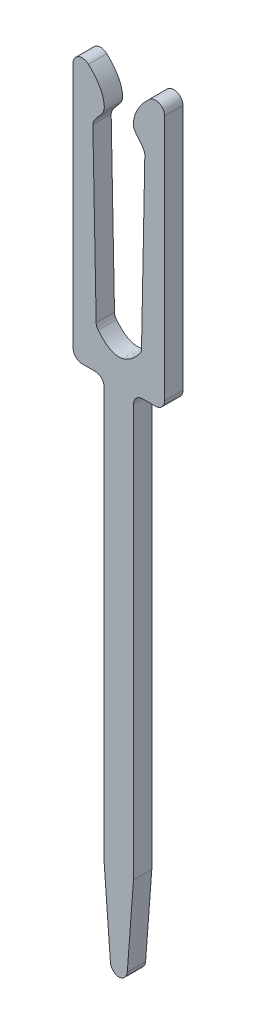
ISO-10303-21;
HEADER;
FILE_DESCRIPTION(('STEP AP214'),'2;1');
FILE_NAME('part.step','',(''),(''),'','','');
FILE_SCHEMA(('AUTOMOTIVE_DESIGN { 1 0 10303 214 1 1 1 1 }'));
ENDSEC;
DATA;
#1=APPLICATION_CONTEXT('core data for automotive mechanical design processes');
#2=APPLICATION_PROTOCOL_DEFINITION('international standard','automotive_design',2000,#1);
#3=PRODUCT_CONTEXT('',#1,'mechanical');
#4=PRODUCT('Part','Part','',(#3));
#5=PRODUCT_RELATED_PRODUCT_CATEGORY('part','',(#4));
#6=PRODUCT_DEFINITION_FORMATION('','',#4);
#7=PRODUCT_DEFINITION_CONTEXT('part definition',#1,'design');
#8=PRODUCT_DEFINITION('design','',#6,#7);
#9=PRODUCT_DEFINITION_SHAPE('','',#8);
#10=(LENGTH_UNIT() NAMED_UNIT(*) SI_UNIT(.MILLI.,.METRE.));
#11=(NAMED_UNIT(*) PLANE_ANGLE_UNIT() SI_UNIT($,.RADIAN.));
#12=(NAMED_UNIT(*) SI_UNIT($,.STERADIAN.) SOLID_ANGLE_UNIT());
#13=UNCERTAINTY_MEASURE_WITH_UNIT(LENGTH_MEASURE(1.E-05),#10,'distance_accuracy_value','');
#14=(GEOMETRIC_REPRESENTATION_CONTEXT(3) GLOBAL_UNCERTAINTY_ASSIGNED_CONTEXT((#13)) GLOBAL_UNIT_ASSIGNED_CONTEXT((#10,
#11,#12)) REPRESENTATION_CONTEXT('',''));
#15=CARTESIAN_POINT('',(0.,0.,0.));
#16=DIRECTION('',(0.,0.,1.));
#17=DIRECTION('',(1.,0.,0.));
#18=AXIS2_PLACEMENT_3D('',#15,#16,#17);
#19=CARTESIAN_POINT('',(0.0155617112013406,-9.53322485209548,-0.2));
#20=DIRECTION('',(0.,0.,1.));
#21=DIRECTION('',(1.,0.,0.));
#22=AXIS2_PLACEMENT_3D('',#19,#20,#21);
#23=CYLINDRICAL_SURFACE('',#22,0.2);
#24=CARTESIAN_POINT('',(0.0155617112013406,-9.53322485209548,0.2));
#25=DIRECTION('',(0.,0.,1.));
#26=DIRECTION('',(-1.,0.,0.));
#27=AXIS2_PLACEMENT_3D('',#24,#25,#26);
#28=CIRCLE('',#27,0.2);
#29=CARTESIAN_POINT('',(-0.183878150776374,-9.54818284174351,0.2));
#30=VERTEX_POINT('',#29);
#31=CARTESIAN_POINT('',(0.,-9.73261851584758,0.2));
#32=VERTEX_POINT('',#31);
#33=EDGE_CURVE('E221',#30,#32,#28,.T.);
#34=ORIENTED_EDGE('',*,*,#33,.F.);
#35=DIRECTION('',(0.,0.,1.));
#36=VECTOR('',#35,1.);
#37=CARTESIAN_POINT('',(-0.183878150776374,-9.54818284174351,-0.2));
#38=LINE('',#37,#36);
#39=CARTESIAN_POINT('',(-0.183878150776374,-9.54818284174351,-0.2));
#40=VERTEX_POINT('',#39);
#41=EDGE_CURVE('E11',#40,#30,#38,.T.);
#42=ORIENTED_EDGE('',*,*,#41,.F.);
#43=CARTESIAN_POINT('',(0.0155617112013406,-9.53322485209548,-0.2));
#44=DIRECTION('',(0.,0.,1.));
#45=DIRECTION('',(-1.,0.,0.));
#46=AXIS2_PLACEMENT_3D('',#43,#44,#45);
#47=CIRCLE('',#46,0.2);
#48=CARTESIAN_POINT('',(0.,-9.73261851584758,-0.2));
#49=VERTEX_POINT('',#48);
#50=EDGE_CURVE('E301',#40,#49,#47,.T.);
#51=ORIENTED_EDGE('',*,*,#50,.T.);
#52=DIRECTION('',(0.,0.,1.));
#53=VECTOR('',#52,1.);
#54=CARTESIAN_POINT('',(0.,-9.73261851584758,-0.2));
#55=LINE('',#54,#53);
#56=EDGE_CURVE('E37',#49,#32,#55,.T.);
#57=ORIENTED_EDGE('',*,*,#56,.T.);
#58=EDGE_LOOP('',(#34,#42,#51,#57));
#59=FACE_BOUND('',#58,.T.);
#60=ADVANCED_FACE('F34',(#59),#23,.T.);
#61=CARTESIAN_POINT('',(-0.183878150776374,-9.54818284174351,-0.2));
#62=DIRECTION('',(-0.997199309888568,-0.074789948240152,0.));
#63=DIRECTION('',(0.074789948240152,-0.997199309888568,0.));
#64=AXIS2_PLACEMENT_3D('',#61,#62,#63);
#65=PLANE('',#64);
#66=DIRECTION('',(0.074789948240152,-0.997199309888568,0.));
#67=VECTOR('',#66,1.);
#68=CARTESIAN_POINT('',(-0.183878150776374,-9.54818284174351,0.2));
#69=LINE('',#68,#67);
#70=CARTESIAN_POINT('',(-0.319999999997298,-7.73322485209503,0.2));
#71=VERTEX_POINT('',#70);
#72=EDGE_CURVE('E299',#71,#30,#69,.T.);
#73=ORIENTED_EDGE('',*,*,#72,.F.);
#74=DIRECTION('',(0.,0.,1.));
#75=VECTOR('',#74,1.);
#76=CARTESIAN_POINT('',(-0.319999999997298,-7.73322485209503,-0.2));
#77=LINE('',#76,#75);
#78=CARTESIAN_POINT('',(-0.319999999997298,-7.73322485209503,-0.2));
#79=VERTEX_POINT('',#78);
#80=EDGE_CURVE('E43',#79,#71,#77,.T.);
#81=ORIENTED_EDGE('',*,*,#80,.F.);
#82=DIRECTION('',(0.074789948240152,-0.997199309888568,0.));
#83=VECTOR('',#82,1.);
#84=CARTESIAN_POINT('',(-0.183878150776374,-9.54818284174351,-0.2));
#85=LINE('',#84,#83);
#86=EDGE_CURVE('E211',#79,#40,#85,.T.);
#87=ORIENTED_EDGE('',*,*,#86,.T.);
#88=ORIENTED_EDGE('',*,*,#41,.T.);
#89=EDGE_LOOP('',(#73,#81,#87,#88));
#90=FACE_BOUND('',#89,.T.);
#91=ADVANCED_FACE('F343',(#90),#65,.T.);
#92=CARTESIAN_POINT('',(-0.319999999997298,-7.73322485209503,-0.2));
#93=DIRECTION('',(-1.,0.,0.));
#94=DIRECTION('',(0.,-1.,0.));
#95=AXIS2_PLACEMENT_3D('',#92,#93,#94);
#96=PLANE('',#95);
#97=DIRECTION('',(0.,-1.,0.));
#98=VECTOR('',#97,1.);
#99=CARTESIAN_POINT('',(-0.319999999997298,-7.73322485209503,0.2));
#100=LINE('',#99,#98);
#101=CARTESIAN_POINT('',(-0.319999999997298,1.26677514790497,0.2));
#102=VERTEX_POINT('',#101);
#103=EDGE_CURVE('E198',#102,#71,#100,.T.);
#104=ORIENTED_EDGE('',*,*,#103,.F.);
#105=DIRECTION('',(0.,0.,1.));
#106=VECTOR('',#105,1.);
#107=CARTESIAN_POINT('',(-0.319999999997298,1.26677514790497,-0.2));
#108=LINE('',#107,#106);
#109=CARTESIAN_POINT('',(-0.319999999997298,1.26677514790497,-0.2));
#110=VERTEX_POINT('',#109);
#111=EDGE_CURVE('E193',#110,#102,#108,.T.);
#112=ORIENTED_EDGE('',*,*,#111,.F.);
#113=DIRECTION('',(0.,-1.,0.));
#114=VECTOR('',#113,1.);
#115=CARTESIAN_POINT('',(-0.319999999997298,-7.73322485209503,-0.2));
#116=LINE('',#115,#114);
#117=EDGE_CURVE('E196',#110,#79,#116,.T.);
#118=ORIENTED_EDGE('',*,*,#117,.T.);
#119=ORIENTED_EDGE('',*,*,#80,.T.);
#120=EDGE_LOOP('',(#104,#112,#118,#119));
#121=FACE_BOUND('',#120,.T.);
#122=ADVANCED_FACE('F195',(#121),#96,.T.);
#123=CARTESIAN_POINT('',(-0.519999999997296,1.26677514790497,-0.2));
#124=DIRECTION('',(0.,0.,1.));
#125=DIRECTION('',(1.,0.,0.));
#126=AXIS2_PLACEMENT_3D('',#123,#124,#125);
#127=CYLINDRICAL_SURFACE('',#126,0.199999999999999);
#128=CARTESIAN_POINT('',(-0.519999999997296,1.26677514790497,0.2));
#129=DIRECTION('',(0.,0.,-1.));
#130=DIRECTION('',(1.,0.,0.));
#131=AXIS2_PLACEMENT_3D('',#128,#129,#130);
#132=CIRCLE('',#131,0.199999999999999);
#133=CARTESIAN_POINT('',(-0.519999999997296,1.46677514790497,0.2));
#134=VERTEX_POINT('',#133);
#135=EDGE_CURVE('E296',#134,#102,#132,.T.);
#136=ORIENTED_EDGE('',*,*,#135,.F.);
#137=DIRECTION('',(0.,0.,1.));
#138=VECTOR('',#137,1.);
#139=CARTESIAN_POINT('',(-0.519999999997296,1.46677514790497,-0.2));
#140=LINE('',#139,#138);
#141=CARTESIAN_POINT('',(-0.519999999997296,1.46677514790497,-0.2));
#142=VERTEX_POINT('',#141);
#143=EDGE_CURVE('E203',#142,#134,#140,.T.);
#144=ORIENTED_EDGE('',*,*,#143,.F.);
#145=CARTESIAN_POINT('',(-0.519999999997296,1.26677514790497,-0.2));
#146=DIRECTION('',(0.,0.,-1.));
#147=DIRECTION('',(1.,0.,0.));
#148=AXIS2_PLACEMENT_3D('',#145,#146,#147);
#149=CIRCLE('',#148,0.199999999999999);
#150=EDGE_CURVE('E209',#142,#110,#149,.T.);
#151=ORIENTED_EDGE('',*,*,#150,.T.);
#152=ORIENTED_EDGE('',*,*,#111,.T.);
#153=EDGE_LOOP('',(#136,#144,#151,#152));
#154=FACE_BOUND('',#153,.T.);
#155=ADVANCED_FACE('F213',(#154),#127,.F.);
#156=CARTESIAN_POINT('',(-0.519999999997296,1.46677514790497,-0.2));
#157=DIRECTION('',(0.,-1.,0.));
#158=DIRECTION('',(0.,0.,-1.));
#159=AXIS2_PLACEMENT_3D('',#156,#157,#158);
#160=PLANE('',#159);
#161=DIRECTION('',(1.,0.,0.));
#162=VECTOR('',#161,1.);
#163=CARTESIAN_POINT('',(-0.519999999997296,1.46677514790497,0.2));
#164=LINE('',#163,#162);
#165=CARTESIAN_POINT('',(-0.799999999997301,1.46677514790497,0.2));
#166=VERTEX_POINT('',#165);
#167=EDGE_CURVE('E293',#166,#134,#164,.T.);
#168=ORIENTED_EDGE('',*,*,#167,.F.);
#169=DIRECTION('',(0.,0.,1.));
#170=VECTOR('',#169,1.);
#171=CARTESIAN_POINT('',(-0.799999999997301,1.46677514790497,-0.2));
#172=LINE('',#171,#170);
#173=CARTESIAN_POINT('',(-0.799999999997301,1.46677514790497,-0.2));
#174=VERTEX_POINT('',#173);
#175=EDGE_CURVE('E305',#174,#166,#172,.T.);
#176=ORIENTED_EDGE('',*,*,#175,.F.);
#177=DIRECTION('',(1.,0.,0.));
#178=VECTOR('',#177,1.);
#179=CARTESIAN_POINT('',(-0.519999999997296,1.46677514790497,-0.2));
#180=LINE('',#179,#178);
#181=EDGE_CURVE('E214',#174,#142,#180,.T.);
#182=ORIENTED_EDGE('',*,*,#181,.T.);
#183=ORIENTED_EDGE('',*,*,#143,.T.);
#184=EDGE_LOOP('',(#168,#176,#182,#183));
#185=FACE_BOUND('',#184,.T.);
#186=ADVANCED_FACE('F356',(#185),#160,.T.);
#187=CARTESIAN_POINT('',(-0.799999999997301,1.66677514790497,-0.2));
#188=DIRECTION('',(0.,0.,1.));
#189=DIRECTION('',(1.,0.,0.));
#190=AXIS2_PLACEMENT_3D('',#187,#188,#189);
#191=CYLINDRICAL_SURFACE('',#190,0.199999999999999);
#192=CARTESIAN_POINT('',(-0.799999999997301,1.66677514790497,0.2));
#193=DIRECTION('',(0.,0.,1.));
#194=DIRECTION('',(-1.,0.,0.));
#195=AXIS2_PLACEMENT_3D('',#192,#193,#194);
#196=CIRCLE('',#195,0.199999999999999);
#197=CARTESIAN_POINT('',(-0.999999999997299,1.66677514790497,0.2));
#198=VERTEX_POINT('',#197);
#199=EDGE_CURVE('E290',#198,#166,#196,.T.);
#200=ORIENTED_EDGE('',*,*,#199,.F.);
#201=DIRECTION('',(0.,0.,1.));
#202=VECTOR('',#201,1.);
#203=CARTESIAN_POINT('',(-0.999999999997299,1.66677514790497,-0.2));
#204=LINE('',#203,#202);
#205=CARTESIAN_POINT('',(-0.999999999997299,1.66677514790497,-0.2));
#206=VERTEX_POINT('',#205);
#207=EDGE_CURVE('E307',#206,#198,#204,.T.);
#208=ORIENTED_EDGE('',*,*,#207,.F.);
#209=CARTESIAN_POINT('',(-0.799999999997301,1.66677514790497,-0.2));
#210=DIRECTION('',(0.,0.,1.));
#211=DIRECTION('',(-1.,0.,0.));
#212=AXIS2_PLACEMENT_3D('',#209,#210,#211);
#213=CIRCLE('',#212,0.199999999999999);
#214=EDGE_CURVE('E216',#206,#174,#213,.T.);
#215=ORIENTED_EDGE('',*,*,#214,.T.);
#216=ORIENTED_EDGE('',*,*,#175,.T.);
#217=EDGE_LOOP('',(#200,#208,#215,#216));
#218=FACE_BOUND('',#217,.T.);
#219=ADVANCED_FACE('F359',(#218),#191,.T.);
#220=CARTESIAN_POINT('',(-0.999999999997299,1.66677514790497,-0.2));
#221=DIRECTION('',(-1.,0.,0.));
#222=DIRECTION('',(0.,0.,1.));
#223=AXIS2_PLACEMENT_3D('',#220,#221,#222);
#224=PLANE('',#223);
#225=DIRECTION('',(0.,-1.,0.));
#226=VECTOR('',#225,1.);
#227=CARTESIAN_POINT('',(-0.999999999997299,1.66677514790497,0.2));
#228=LINE('',#227,#226);
#229=CARTESIAN_POINT('',(-0.999999999997299,7.05719868487585,0.2));
#230=VERTEX_POINT('',#229);
#231=EDGE_CURVE('E287',#230,#198,#228,.T.);
#232=ORIENTED_EDGE('',*,*,#231,.F.);
#233=DIRECTION('',(0.,0.,1.));
#234=VECTOR('',#233,1.);
#235=CARTESIAN_POINT('',(-0.999999999997299,7.05719868487585,-0.2));
#236=LINE('',#235,#234);
#237=CARTESIAN_POINT('',(-0.999999999997299,7.05719868487585,-0.2));
#238=VERTEX_POINT('',#237);
#239=EDGE_CURVE('E309',#238,#230,#236,.T.);
#240=ORIENTED_EDGE('',*,*,#239,.F.);
#241=DIRECTION('',(0.,-1.,0.));
#242=VECTOR('',#241,1.);
#243=CARTESIAN_POINT('',(-0.999999999997299,1.66677514790497,-0.2));
#244=LINE('',#243,#242);
#245=EDGE_CURVE('E394',#238,#206,#244,.T.);
#246=ORIENTED_EDGE('',*,*,#245,.T.);
#247=ORIENTED_EDGE('',*,*,#207,.T.);
#248=EDGE_LOOP('',(#232,#240,#246,#247));
#249=FACE_BOUND('',#248,.T.);
#250=ADVANCED_FACE('F363',(#249),#224,.T.);
#251=CARTESIAN_POINT('',(-0.799999999997313,7.05719868487585,-0.2));
#252=DIRECTION('',(0.,0.,1.));
#253=DIRECTION('',(1.,0.,0.));
#254=AXIS2_PLACEMENT_3D('',#251,#252,#253);
#255=CYLINDRICAL_SURFACE('',#254,0.199999999999987);
#256=CARTESIAN_POINT('',(-0.799999999997313,7.05719868487585,0.2));
#257=DIRECTION('',(0.,0.,1.));
#258=DIRECTION('',(-1.,0.,0.));
#259=AXIS2_PLACEMENT_3D('',#256,#257,#258);
#260=CIRCLE('',#259,0.199999999999987);
#261=CARTESIAN_POINT('',(-0.663039519004161,7.20294444517823,0.2));
#262=VERTEX_POINT('',#261);
#263=EDGE_CURVE('E281',#262,#230,#260,.T.);
#264=ORIENTED_EDGE('',*,*,#263,.F.);
#265=DIRECTION('',(0.,0.,1.));
#266=VECTOR('',#265,1.);
#267=CARTESIAN_POINT('',(-0.663039519004161,7.20294444517823,-0.2));
#268=LINE('',#267,#266);
#269=CARTESIAN_POINT('',(-0.663039519004161,7.20294444517823,-0.2));
#270=VERTEX_POINT('',#269);
#271=EDGE_CURVE('E311',#270,#262,#268,.T.);
#272=ORIENTED_EDGE('',*,*,#271,.F.);
#273=CARTESIAN_POINT('',(-0.799999999997313,7.05719868487585,-0.2));
#274=DIRECTION('',(0.,0.,1.));
#275=DIRECTION('',(-1.,0.,0.));
#276=AXIS2_PLACEMENT_3D('',#273,#274,#275);
#277=CIRCLE('',#276,0.199999999999987);
#278=EDGE_CURVE('E386',#270,#238,#277,.T.);
#279=ORIENTED_EDGE('',*,*,#278,.T.);
#280=ORIENTED_EDGE('',*,*,#239,.T.);
#281=EDGE_LOOP('',(#264,#272,#279,#280));
#282=FACE_BOUND('',#281,.T.);
#283=ADVANCED_FACE('F367',(#282),#255,.T.);
#284=CARTESIAN_POINT('',(-0.567669207755582,6.10834496937554,-0.2));
#285=CARTESIAN_POINT('',(-0.548453887561712,6.27598469580024,-0.2));
#286=CARTESIAN_POINT('',(-0.31067113223224,6.38824738927313,-0.2));
#287=CARTESIAN_POINT('',(-0.326177603548469,6.81615503897428,-0.2));
#288=CARTESIAN_POINT('',(-0.487599251440381,7.03807938574774,-0.2));
#289=CARTESIAN_POINT('',(-0.663039519004161,7.20294444517823,-0.2));
#290=B_SPLINE_CURVE_WITH_KNOTS('',3,(#284,#285,#286,#287,#288,#289),.UNSPECIFIED.,.F.,.F.,(4,1,
1,4),(0.253308427317744,0.546240991694777,0.590136450844154,1.),.UNSPECIFIED.);
#291=DIRECTION('',(0.,0.,1.));
#292=VECTOR('',#291,1.);
#293=SURFACE_OF_LINEAR_EXTRUSION('',#290,#292);
#294=CARTESIAN_POINT('',(-0.567669207755582,6.10834496937554,0.2));
#295=CARTESIAN_POINT('',(-0.548453887561712,6.27598469580024,0.2));
#296=CARTESIAN_POINT('',(-0.31067113223224,6.38824738927313,0.2));
#297=CARTESIAN_POINT('',(-0.326177603548469,6.81615503897428,0.2));
#298=CARTESIAN_POINT('',(-0.487599251440381,7.03807938574774,0.2));
#299=CARTESIAN_POINT('',(-0.663039519004161,7.20294444517823,0.2));
#300=B_SPLINE_CURVE_WITH_KNOTS('',3,(#294,#295,#296,#297,#298,#299),.UNSPECIFIED.,.F.,.F.,(4,1,
1,4),(0.253308427317744,0.546240991694777,0.590136450844154,1.),.UNSPECIFIED.);
#301=CARTESIAN_POINT('',(-0.567669207755582,6.10834496937554,0.2));
#302=VERTEX_POINT('',#301);
#303=EDGE_CURVE('E276',#302,#262,#300,.T.);
#304=ORIENTED_EDGE('',*,*,#303,.F.);
#305=DIRECTION('',(0.,0.,1.));
#306=VECTOR('',#305,1.);
#307=CARTESIAN_POINT('',(-0.567669207755582,6.10834496937554,-0.2));
#308=LINE('',#307,#306);
#309=CARTESIAN_POINT('',(-0.567669207755582,6.10834496937554,-0.2));
#310=VERTEX_POINT('',#309);
#311=EDGE_CURVE('E313',#310,#302,#308,.T.);
#312=ORIENTED_EDGE('',*,*,#311,.F.);
#313=EDGE_CURVE('E379',#310,#270,#290,.T.);
#314=ORIENTED_EDGE('',*,*,#313,.T.);
#315=ORIENTED_EDGE('',*,*,#271,.T.);
#316=EDGE_LOOP('',(#304,#312,#314,#315));
#317=FACE_BOUND('',#316,.T.);
#318=ADVANCED_FACE('F371',(#317),#293,.T.);
#319=CARTESIAN_POINT('',(-0.567669207755582,6.10834496937554,-0.2));
#320=DIRECTION('',(0.999809016262246,0.0195430550508496,0.));
#321=DIRECTION('',(-0.0195430550508496,0.999809016262246,0.));
#322=AXIS2_PLACEMENT_3D('',#319,#320,#321);
#323=PLANE('',#322);
#324=DIRECTION('',(-0.0195430550508496,0.999809016262246,0.));
#325=VECTOR('',#324,1.);
#326=CARTESIAN_POINT('',(-0.567669207755582,6.10834496937554,0.2));
#327=LINE('',#326,#325);
#328=CARTESIAN_POINT('',(-0.495215905001466,2.40168471778945,0.2));
#329=VERTEX_POINT('',#328);
#330=EDGE_CURVE('E273',#329,#302,#327,.T.);
#331=ORIENTED_EDGE('',*,*,#330,.F.);
#332=DIRECTION('',(0.,0.,1.));
#333=VECTOR('',#332,1.);
#334=CARTESIAN_POINT('',(-0.495215905001466,2.40168471778945,-0.2));
#335=LINE('',#334,#333);
#336=CARTESIAN_POINT('',(-0.495215905001466,2.40168471778945,-0.2));
#337=VERTEX_POINT('',#336);
#338=EDGE_CURVE('E315',#337,#329,#335,.T.);
#339=ORIENTED_EDGE('',*,*,#338,.F.);
#340=DIRECTION('',(-0.0195430550508496,0.999809016262246,0.));
#341=VECTOR('',#340,1.);
#342=CARTESIAN_POINT('',(-0.567669207755582,6.10834496937554,-0.2));
#343=LINE('',#342,#341);
#344=EDGE_CURVE('E387',#337,#310,#343,.T.);
#345=ORIENTED_EDGE('',*,*,#344,.T.);
#346=ORIENTED_EDGE('',*,*,#311,.T.);
#347=EDGE_LOOP('',(#331,#339,#345,#346));
#348=FACE_BOUND('',#347,.T.);
#349=ADVANCED_FACE('F376',(#348),#323,.T.);
#350=CARTESIAN_POINT('',(-0.295254101749009,2.40559332879962,-0.2));
#351=DIRECTION('',(0.,0.,1.));
#352=DIRECTION('',(1.,0.,0.));
#353=AXIS2_PLACEMENT_3D('',#350,#351,#352);
#354=CYLINDRICAL_SURFACE('',#353,0.200000000000008);
#355=CARTESIAN_POINT('',(-0.295254101749009,2.40559332879962,0.2));
#356=DIRECTION('',(0.,0.,-1.));
#357=DIRECTION('',(1.,0.,0.));
#358=AXIS2_PLACEMENT_3D('',#355,#356,#357);
#359=CIRCLE('',#358,0.200000000000008);
#360=CARTESIAN_POINT('',(-0.451053838511068,2.28018821716187,0.2));
#361=VERTEX_POINT('',#360);
#362=EDGE_CURVE('E267',#361,#329,#359,.T.);
#363=ORIENTED_EDGE('',*,*,#362,.F.);
#364=DIRECTION('',(0.,0.,1.));
#365=VECTOR('',#364,1.);
#366=CARTESIAN_POINT('',(-0.451053838511068,2.28018821716187,-0.2));
#367=LINE('',#366,#365);
#368=CARTESIAN_POINT('',(-0.451053838511068,2.28018821716187,-0.2));
#369=VERTEX_POINT('',#368);
#370=EDGE_CURVE('E317',#369,#361,#367,.T.);
#371=ORIENTED_EDGE('',*,*,#370,.F.);
#372=CARTESIAN_POINT('',(-0.295254101749009,2.40559332879962,-0.2));
#373=DIRECTION('',(0.,0.,-1.));
#374=DIRECTION('',(1.,0.,0.));
#375=AXIS2_PLACEMENT_3D('',#372,#373,#374);
#376=CIRCLE('',#375,0.200000000000008);
#377=EDGE_CURVE('E412',#369,#337,#376,.T.);
#378=ORIENTED_EDGE('',*,*,#377,.T.);
#379=ORIENTED_EDGE('',*,*,#338,.T.);
#380=EDGE_LOOP('',(#363,#371,#378,#379));
#381=FACE_BOUND('',#380,.T.);
#382=ADVANCED_FACE('F431',(#381),#354,.F.);
#383=CARTESIAN_POINT('',(0.451053838511063,2.28018821716187,-0.2));
#384=CARTESIAN_POINT('',(0.,1.71981178283813,-0.2));
#385=CARTESIAN_POINT('',(-0.451053838511063,2.28018821716187,-0.2));
#386=B_SPLINE_CURVE_WITH_KNOTS('',2,(#383,#384,#385),.UNSPECIFIED.,.F.,.F.,(3,3),
(0.0434047342329982,0.956595265767001),.UNSPECIFIED.);
#387=DIRECTION('',(0.,0.,1.));
#388=VECTOR('',#387,1.);
#389=SURFACE_OF_LINEAR_EXTRUSION('',#386,#388);
#390=CARTESIAN_POINT('',(0.451053838511063,2.28018821716187,0.2));
#391=CARTESIAN_POINT('',(0.,1.71981178283813,0.2));
#392=CARTESIAN_POINT('',(-0.451053838511063,2.28018821716187,0.2));
#393=B_SPLINE_CURVE_WITH_KNOTS('',2,(#390,#391,#392),.UNSPECIFIED.,.F.,.F.,(3,3),
(0.0434047342329982,0.956595265767001),.UNSPECIFIED.);
#394=CARTESIAN_POINT('',(0.451053838511063,2.28018821716187,0.2));
#395=VERTEX_POINT('',#394);
#396=EDGE_CURVE('E262',#395,#361,#393,.T.);
#397=ORIENTED_EDGE('',*,*,#396,.F.);
#398=DIRECTION('',(0.,0.,1.));
#399=VECTOR('',#398,1.);
#400=CARTESIAN_POINT('',(0.451053838511063,2.28018821716187,-0.2));
#401=LINE('',#400,#399);
#402=CARTESIAN_POINT('',(0.451053838511063,2.28018821716187,-0.2));
#403=VERTEX_POINT('',#402);
#404=EDGE_CURVE('E319',#403,#395,#401,.T.);
#405=ORIENTED_EDGE('',*,*,#404,.F.);
#406=EDGE_CURVE('E413',#403,#369,#386,.T.);
#407=ORIENTED_EDGE('',*,*,#406,.T.);
#408=ORIENTED_EDGE('',*,*,#370,.T.);
#409=EDGE_LOOP('',(#397,#405,#407,#408));
#410=FACE_BOUND('',#409,.T.);
#411=ADVANCED_FACE('F427',(#410),#389,.T.);
#412=CARTESIAN_POINT('',(0.29525410174901,2.40559332879962,-0.2));
#413=DIRECTION('',(0.,0.,1.));
#414=DIRECTION('',(1.,0.,0.));
#415=AXIS2_PLACEMENT_3D('',#412,#413,#414);
#416=CYLINDRICAL_SURFACE('',#415,0.200000000000008);
#417=CARTESIAN_POINT('',(0.29525410174901,2.40559332879962,0.2));
#418=DIRECTION('',(0.,0.,-1.));
#419=DIRECTION('',(-1.,0.,0.));
#420=AXIS2_PLACEMENT_3D('',#417,#418,#419);
#421=CIRCLE('',#420,0.200000000000008);
#422=CARTESIAN_POINT('',(0.495215905001468,2.40168471778945,0.2));
#423=VERTEX_POINT('',#422);
#424=EDGE_CURVE('E259',#423,#395,#421,.T.);
#425=ORIENTED_EDGE('',*,*,#424,.F.);
#426=DIRECTION('',(0.,0.,1.));
#427=VECTOR('',#426,1.);
#428=CARTESIAN_POINT('',(0.495215905001468,2.40168471778945,-0.2));
#429=LINE('',#428,#427);
#430=CARTESIAN_POINT('',(0.495215905001468,2.40168471778945,-0.2));
#431=VERTEX_POINT('',#430);
#432=EDGE_CURVE('E321',#431,#423,#429,.T.);
#433=ORIENTED_EDGE('',*,*,#432,.F.);
#434=CARTESIAN_POINT('',(0.29525410174901,2.40559332879962,-0.2));
#435=DIRECTION('',(0.,0.,-1.));
#436=DIRECTION('',(-1.,0.,0.));
#437=AXIS2_PLACEMENT_3D('',#434,#435,#436);
#438=CIRCLE('',#437,0.200000000000008);
#439=EDGE_CURVE('E416',#431,#403,#438,.T.);
#440=ORIENTED_EDGE('',*,*,#439,.T.);
#441=ORIENTED_EDGE('',*,*,#404,.T.);
#442=EDGE_LOOP('',(#425,#433,#440,#441));
#443=FACE_BOUND('',#442,.T.);
#444=ADVANCED_FACE('F430',(#443),#416,.F.);
#445=CARTESIAN_POINT('',(0.567669207755584,6.10834496937554,-0.2));
#446=DIRECTION('',(-0.999809016262246,0.0195430550508496,0.));
#447=DIRECTION('',(-0.0195430550508496,-0.999809016262246,0.));
#448=AXIS2_PLACEMENT_3D('',#445,#446,#447);
#449=PLANE('',#448);
#450=DIRECTION('',(-0.0195430550508496,-0.999809016262246,0.));
#451=VECTOR('',#450,1.);
#452=CARTESIAN_POINT('',(0.567669207755584,6.10834496937554,0.2));
#453=LINE('',#452,#451);
#454=CARTESIAN_POINT('',(0.567669207755584,6.10834496937554,0.2));
#455=VERTEX_POINT('',#454);
#456=EDGE_CURVE('E253',#455,#423,#453,.T.);
#457=ORIENTED_EDGE('',*,*,#456,.F.);
#458=DIRECTION('',(0.,0.,1.));
#459=VECTOR('',#458,1.);
#460=CARTESIAN_POINT('',(0.567669207755584,6.10834496937554,-0.2));
#461=LINE('',#460,#459);
#462=CARTESIAN_POINT('',(0.567669207755584,6.10834496937554,-0.2));
#463=VERTEX_POINT('',#462);
#464=EDGE_CURVE('E323',#463,#455,#461,.T.);
#465=ORIENTED_EDGE('',*,*,#464,.F.);
#466=DIRECTION('',(-0.0195430550508496,-0.999809016262246,0.));
#467=VECTOR('',#466,1.);
#468=CARTESIAN_POINT('',(0.567669207755584,6.10834496937554,-0.2));
#469=LINE('',#468,#467);
#470=EDGE_CURVE('E453',#463,#431,#469,.T.);
#471=ORIENTED_EDGE('',*,*,#470,.T.);
#472=ORIENTED_EDGE('',*,*,#432,.T.);
#473=EDGE_LOOP('',(#457,#465,#471,#472));
#474=FACE_BOUND('',#473,.T.);
#475=ADVANCED_FACE('F435',(#474),#449,.T.);
#476=CARTESIAN_POINT('',(0.663039519004162,7.20294444517823,-0.2));
#477=CARTESIAN_POINT('',(0.487599251440373,7.03807938574778,-0.2));
#478=CARTESIAN_POINT('',(0.326177603548459,6.8161550389743,-0.2));
#479=CARTESIAN_POINT('',(0.310671132232229,6.38824738927312,-0.2));
#480=CARTESIAN_POINT('',(0.548453887561716,6.27598469580024,-0.2));
#481=CARTESIAN_POINT('',(0.567669207755584,6.10834496937554,-0.2));
#482=B_SPLINE_CURVE_WITH_KNOTS('',3,(#476,#477,#478,#479,#480,#481),.UNSPECIFIED.,.F.,.F.,(4,1,
1,4),(0.253308427317744,0.66317197647359,0.707067435622967,1.),.UNSPECIFIED.);
#483=DIRECTION('',(0.,0.,1.));
#484=VECTOR('',#483,1.);
#485=SURFACE_OF_LINEAR_EXTRUSION('',#482,#484);
#486=CARTESIAN_POINT('',(0.663039519004162,7.20294444517823,0.2));
#487=CARTESIAN_POINT('',(0.487599251440373,7.03807938574778,0.2));
#488=CARTESIAN_POINT('',(0.326177603548459,6.8161550389743,0.2));
#489=CARTESIAN_POINT('',(0.310671132232229,6.38824738927312,0.2));
#490=CARTESIAN_POINT('',(0.548453887561716,6.27598469580024,0.2));
#491=CARTESIAN_POINT('',(0.567669207755584,6.10834496937554,0.2));
#492=B_SPLINE_CURVE_WITH_KNOTS('',3,(#486,#487,#488,#489,#490,#491),.UNSPECIFIED.,.F.,.F.,(4,1,
1,4),(0.253308427317744,0.66317197647359,0.707067435622967,1.),.UNSPECIFIED.);
#493=CARTESIAN_POINT('',(0.663039519004162,7.20294444517823,0.2));
#494=VERTEX_POINT('',#493);
#495=EDGE_CURVE('E248',#494,#455,#492,.T.);
#496=ORIENTED_EDGE('',*,*,#495,.F.);
#497=DIRECTION('',(0.,0.,1.));
#498=VECTOR('',#497,1.);
#499=CARTESIAN_POINT('',(0.663039519004162,7.20294444517823,-0.2));
#500=LINE('',#499,#498);
#501=CARTESIAN_POINT('',(0.663039519004162,7.20294444517823,-0.2));
#502=VERTEX_POINT('',#501);
#503=EDGE_CURVE('E325',#502,#494,#500,.T.);
#504=ORIENTED_EDGE('',*,*,#503,.F.);
#505=EDGE_CURVE('E447',#502,#463,#482,.T.);
#506=ORIENTED_EDGE('',*,*,#505,.T.);
#507=ORIENTED_EDGE('',*,*,#464,.T.);
#508=EDGE_LOOP('',(#496,#504,#506,#507));
#509=FACE_BOUND('',#508,.T.);
#510=ADVANCED_FACE('F439',(#509),#485,.T.);
#511=CARTESIAN_POINT('',(0.799999999997314,7.05719868487585,-0.2));
#512=DIRECTION('',(0.,0.,1.));
#513=DIRECTION('',(1.,0.,0.));
#514=AXIS2_PLACEMENT_3D('',#511,#512,#513);
#515=CYLINDRICAL_SURFACE('',#514,0.199999999999987);
#516=CARTESIAN_POINT('',(0.799999999997314,7.05719868487585,0.2));
#517=DIRECTION('',(0.,0.,1.));
#518=DIRECTION('',(1.,0.,0.));
#519=AXIS2_PLACEMENT_3D('',#516,#517,#518);
#520=CIRCLE('',#519,0.199999999999987);
#521=CARTESIAN_POINT('',(0.999999999997301,7.05719868487585,0.2));
#522=VERTEX_POINT('',#521);
#523=EDGE_CURVE('E245',#522,#494,#520,.T.);
#524=ORIENTED_EDGE('',*,*,#523,.F.);
#525=DIRECTION('',(0.,0.,1.));
#526=VECTOR('',#525,1.);
#527=CARTESIAN_POINT('',(0.999999999997301,7.05719868487585,-0.2));
#528=LINE('',#527,#526);
#529=CARTESIAN_POINT('',(0.999999999997301,7.05719868487585,-0.2));
#530=VERTEX_POINT('',#529);
#531=EDGE_CURVE('E327',#530,#522,#528,.T.);
#532=ORIENTED_EDGE('',*,*,#531,.F.);
#533=CARTESIAN_POINT('',(0.799999999997314,7.05719868487585,-0.2));
#534=DIRECTION('',(0.,0.,1.));
#535=DIRECTION('',(1.,0.,0.));
#536=AXIS2_PLACEMENT_3D('',#533,#534,#535);
#537=CIRCLE('',#536,0.199999999999987);
#538=EDGE_CURVE('E454',#530,#502,#537,.T.);
#539=ORIENTED_EDGE('',*,*,#538,.T.);
#540=ORIENTED_EDGE('',*,*,#503,.T.);
#541=EDGE_LOOP('',(#524,#532,#539,#540));
#542=FACE_BOUND('',#541,.T.);
#543=ADVANCED_FACE('F444',(#542),#515,.T.);
#544=CARTESIAN_POINT('',(0.999999999997301,1.66677514790497,-0.2));
#545=DIRECTION('',(1.,0.,0.));
#546=DIRECTION('',(0.,0.,-1.));
#547=AXIS2_PLACEMENT_3D('',#544,#545,#546);
#548=PLANE('',#547);
#549=DIRECTION('',(0.,1.,0.));
#550=VECTOR('',#549,1.);
#551=CARTESIAN_POINT('',(0.999999999997301,1.66677514790497,0.2));
#552=LINE('',#551,#550);
#553=CARTESIAN_POINT('',(0.999999999997301,1.66677514790497,0.2));
#554=VERTEX_POINT('',#553);
#555=EDGE_CURVE('E242',#554,#522,#552,.T.);
#556=ORIENTED_EDGE('',*,*,#555,.F.);
#557=DIRECTION('',(0.,0.,1.));
#558=VECTOR('',#557,1.);
#559=CARTESIAN_POINT('',(0.999999999997301,1.66677514790497,-0.2));
#560=LINE('',#559,#558);
#561=CARTESIAN_POINT('',(0.999999999997301,1.66677514790497,-0.2));
#562=VERTEX_POINT('',#561);
#563=EDGE_CURVE('E329',#562,#554,#560,.T.);
#564=ORIENTED_EDGE('',*,*,#563,.F.);
#565=DIRECTION('',(0.,1.,0.));
#566=VECTOR('',#565,1.);
#567=CARTESIAN_POINT('',(0.999999999997301,1.66677514790497,-0.2));
#568=LINE('',#567,#566);
#569=EDGE_CURVE('E476',#562,#530,#568,.T.);
#570=ORIENTED_EDGE('',*,*,#569,.T.);
#571=ORIENTED_EDGE('',*,*,#531,.T.);
#572=EDGE_LOOP('',(#556,#564,#570,#571));
#573=FACE_BOUND('',#572,.T.);
#574=ADVANCED_FACE('F516',(#573),#548,.T.);
#575=CARTESIAN_POINT('',(0.799999999997302,1.66677514790497,-0.2));
#576=DIRECTION('',(0.,0.,1.));
#577=DIRECTION('',(1.,0.,0.));
#578=AXIS2_PLACEMENT_3D('',#575,#576,#577);
#579=CYLINDRICAL_SURFACE('',#578,0.199999999999999);
#580=CARTESIAN_POINT('',(0.799999999997302,1.66677514790497,0.2));
#581=DIRECTION('',(0.,0.,1.));
#582=DIRECTION('',(1.,0.,0.));
#583=AXIS2_PLACEMENT_3D('',#580,#581,#582);
#584=CIRCLE('',#583,0.199999999999999);
#585=CARTESIAN_POINT('',(0.799999999997302,1.46677514790497,0.2));
#586=VERTEX_POINT('',#585);
#587=EDGE_CURVE('E239',#586,#554,#584,.T.);
#588=ORIENTED_EDGE('',*,*,#587,.F.);
#589=DIRECTION('',(0.,0.,1.));
#590=VECTOR('',#589,1.);
#591=CARTESIAN_POINT('',(0.799999999997302,1.46677514790497,-0.2));
#592=LINE('',#591,#590);
#593=CARTESIAN_POINT('',(0.799999999997302,1.46677514790497,-0.2));
#594=VERTEX_POINT('',#593);
#595=EDGE_CURVE('E331',#594,#586,#592,.T.);
#596=ORIENTED_EDGE('',*,*,#595,.F.);
#597=CARTESIAN_POINT('',(0.799999999997302,1.66677514790497,-0.2));
#598=DIRECTION('',(0.,0.,1.));
#599=DIRECTION('',(1.,0.,0.));
#600=AXIS2_PLACEMENT_3D('',#597,#598,#599);
#601=CIRCLE('',#600,0.199999999999999);
#602=EDGE_CURVE('E477',#594,#562,#601,.T.);
#603=ORIENTED_EDGE('',*,*,#602,.T.);
#604=ORIENTED_EDGE('',*,*,#563,.T.);
#605=EDGE_LOOP('',(#588,#596,#603,#604));
#606=FACE_BOUND('',#605,.T.);
#607=ADVANCED_FACE('F514',(#606),#579,.T.);
#608=CARTESIAN_POINT('',(0.519999999997298,1.46677514790497,-0.2));
#609=DIRECTION('',(0.,-1.,0.));
#610=DIRECTION('',(0.,0.,-1.));
#611=AXIS2_PLACEMENT_3D('',#608,#609,#610);
#612=PLANE('',#611);
#613=DIRECTION('',(1.,0.,0.));
#614=VECTOR('',#613,1.);
#615=CARTESIAN_POINT('',(0.519999999997298,1.46677514790497,0.2));
#616=LINE('',#615,#614);
#617=CARTESIAN_POINT('',(0.519999999997298,1.46677514790497,0.2));
#618=VERTEX_POINT('',#617);
#619=EDGE_CURVE('E236',#618,#586,#616,.T.);
#620=ORIENTED_EDGE('',*,*,#619,.F.);
#621=DIRECTION('',(0.,0.,1.));
#622=VECTOR('',#621,1.);
#623=CARTESIAN_POINT('',(0.519999999997298,1.46677514790497,-0.2));
#624=LINE('',#623,#622);
#625=CARTESIAN_POINT('',(0.519999999997298,1.46677514790497,-0.2));
#626=VERTEX_POINT('',#625);
#627=EDGE_CURVE('E333',#626,#618,#624,.T.);
#628=ORIENTED_EDGE('',*,*,#627,.F.);
#629=DIRECTION('',(1.,0.,0.));
#630=VECTOR('',#629,1.);
#631=CARTESIAN_POINT('',(0.519999999997298,1.46677514790497,-0.2));
#632=LINE('',#631,#630);
#633=EDGE_CURVE('E480',#626,#594,#632,.T.);
#634=ORIENTED_EDGE('',*,*,#633,.T.);
#635=ORIENTED_EDGE('',*,*,#595,.T.);
#636=EDGE_LOOP('',(#620,#628,#634,#635));
#637=FACE_BOUND('',#636,.T.);
#638=ADVANCED_FACE('F510',(#637),#612,.T.);
#639=CARTESIAN_POINT('',(0.519999999997298,1.26677514790497,-0.2));
#640=DIRECTION('',(0.,0.,1.));
#641=DIRECTION('',(1.,0.,0.));
#642=AXIS2_PLACEMENT_3D('',#639,#640,#641);
#643=CYLINDRICAL_SURFACE('',#642,0.199999999999999);
#644=CARTESIAN_POINT('',(0.519999999997298,1.26677514790497,0.2));
#645=DIRECTION('',(0.,0.,-1.));
#646=DIRECTION('',(-1.,0.,0.));
#647=AXIS2_PLACEMENT_3D('',#644,#645,#646);
#648=CIRCLE('',#647,0.199999999999999);
#649=CARTESIAN_POINT('',(0.319999999997299,1.26677514790497,0.2));
#650=VERTEX_POINT('',#649);
#651=EDGE_CURVE('E233',#650,#618,#648,.T.);
#652=ORIENTED_EDGE('',*,*,#651,.F.);
#653=DIRECTION('',(0.,0.,1.));
#654=VECTOR('',#653,1.);
#655=CARTESIAN_POINT('',(0.319999999997299,1.26677514790497,-0.2));
#656=LINE('',#655,#654);
#657=CARTESIAN_POINT('',(0.319999999997299,1.26677514790497,-0.2));
#658=VERTEX_POINT('',#657);
#659=EDGE_CURVE('E335',#658,#650,#656,.T.);
#660=ORIENTED_EDGE('',*,*,#659,.F.);
#661=CARTESIAN_POINT('',(0.519999999997298,1.26677514790497,-0.2));
#662=DIRECTION('',(0.,0.,-1.));
#663=DIRECTION('',(-1.,0.,0.));
#664=AXIS2_PLACEMENT_3D('',#661,#662,#663);
#665=CIRCLE('',#664,0.199999999999999);
#666=EDGE_CURVE('E485',#658,#626,#665,.T.);
#667=ORIENTED_EDGE('',*,*,#666,.T.);
#668=ORIENTED_EDGE('',*,*,#627,.T.);
#669=EDGE_LOOP('',(#652,#660,#667,#668));
#670=FACE_BOUND('',#669,.T.);
#671=ADVANCED_FACE('F506',(#670),#643,.F.);
#672=CARTESIAN_POINT('',(0.3199999999973,-7.73322485209503,-0.2));
#673=DIRECTION('',(1.,0.,0.));
#674=DIRECTION('',(0.,1.,0.));
#675=AXIS2_PLACEMENT_3D('',#672,#673,#674);
#676=PLANE('',#675);
#677=DIRECTION('',(0.,1.,0.));
#678=VECTOR('',#677,1.);
#679=CARTESIAN_POINT('',(0.3199999999973,-7.73322485209503,0.2));
#680=LINE('',#679,#678);
#681=CARTESIAN_POINT('',(0.3199999999973,-7.73322485209503,0.2));
#682=VERTEX_POINT('',#681);
#683=EDGE_CURVE('E230',#682,#650,#680,.T.);
#684=ORIENTED_EDGE('',*,*,#683,.F.);
#685=DIRECTION('',(0.,0.,1.));
#686=VECTOR('',#685,1.);
#687=CARTESIAN_POINT('',(0.3199999999973,-7.73322485209503,-0.2));
#688=LINE('',#687,#686);
#689=CARTESIAN_POINT('',(0.3199999999973,-7.73322485209503,-0.2));
#690=VERTEX_POINT('',#689);
#691=EDGE_CURVE('E337',#690,#682,#688,.T.);
#692=ORIENTED_EDGE('',*,*,#691,.F.);
#693=DIRECTION('',(0.,1.,0.));
#694=VECTOR('',#693,1.);
#695=CARTESIAN_POINT('',(0.3199999999973,-7.73322485209503,-0.2));
#696=LINE('',#695,#694);
#697=EDGE_CURVE('E488',#690,#658,#696,.T.);
#698=ORIENTED_EDGE('',*,*,#697,.T.);
#699=ORIENTED_EDGE('',*,*,#659,.T.);
#700=EDGE_LOOP('',(#684,#692,#698,#699));
#701=FACE_BOUND('',#700,.T.);
#702=ADVANCED_FACE('F504',(#701),#676,.T.);
#703=CARTESIAN_POINT('',(0.183878150776377,-9.54818284174351,-0.2));
#704=DIRECTION('',(0.997199309888568,-0.0747899482401518,0.));
#705=DIRECTION('',(0.0747899482401518,0.997199309888568,0.));
#706=AXIS2_PLACEMENT_3D('',#703,#704,#705);
#707=PLANE('',#706);
#708=DIRECTION('',(0.0747899482401518,0.997199309888568,0.));
#709=VECTOR('',#708,1.);
#710=CARTESIAN_POINT('',(0.183878150776377,-9.54818284174351,0.2));
#711=LINE('',#710,#709);
#712=CARTESIAN_POINT('',(0.183878150776377,-9.54818284174351,0.2));
#713=VERTEX_POINT('',#712);
#714=EDGE_CURVE('E227',#713,#682,#711,.T.);
#715=ORIENTED_EDGE('',*,*,#714,.F.);
#716=DIRECTION('',(0.,0.,1.));
#717=VECTOR('',#716,1.);
#718=CARTESIAN_POINT('',(0.183878150776377,-9.54818284174351,-0.2));
#719=LINE('',#718,#717);
#720=CARTESIAN_POINT('',(0.183878150776377,-9.54818284174351,-0.2));
#721=VERTEX_POINT('',#720);
#722=EDGE_CURVE('E338',#721,#713,#719,.T.);
#723=ORIENTED_EDGE('',*,*,#722,.F.);
#724=DIRECTION('',(0.0747899482401518,0.997199309888568,0.));
#725=VECTOR('',#724,1.);
#726=CARTESIAN_POINT('',(0.183878150776377,-9.54818284174351,-0.2));
#727=LINE('',#726,#725);
#728=EDGE_CURVE('E491',#721,#690,#727,.T.);
#729=ORIENTED_EDGE('',*,*,#728,.T.);
#730=ORIENTED_EDGE('',*,*,#691,.T.);
#731=EDGE_LOOP('',(#715,#723,#729,#730));
#732=FACE_BOUND('',#731,.T.);
#733=ADVANCED_FACE('F500',(#732),#707,.T.);
#734=CARTESIAN_POINT('',(-0.0155617112013377,-9.53322485209548,-0.2));
#735=DIRECTION('',(0.,0.,1.));
#736=DIRECTION('',(1.,0.,0.));
#737=AXIS2_PLACEMENT_3D('',#734,#735,#736);
#738=CYLINDRICAL_SURFACE('',#737,0.2);
#739=CARTESIAN_POINT('',(-0.0155617112013377,-9.53322485209548,0.2));
#740=DIRECTION('',(0.,0.,1.));
#741=DIRECTION('',(1.,0.,0.));
#742=AXIS2_PLACEMENT_3D('',#739,#740,#741);
#743=CIRCLE('',#742,0.2);
#744=EDGE_CURVE('E224',#32,#713,#743,.T.);
#745=ORIENTED_EDGE('',*,*,#744,.F.);
#746=ORIENTED_EDGE('',*,*,#56,.F.);
#747=CARTESIAN_POINT('',(-0.0155617112013377,-9.53322485209548,-0.2));
#748=DIRECTION('',(0.,0.,1.));
#749=DIRECTION('',(1.,0.,0.));
#750=AXIS2_PLACEMENT_3D('',#747,#748,#749);
#751=CIRCLE('',#750,0.2);
#752=EDGE_CURVE('E494',#49,#721,#751,.T.);
#753=ORIENTED_EDGE('',*,*,#752,.T.);
#754=ORIENTED_EDGE('',*,*,#722,.T.);
#755=EDGE_LOOP('',(#745,#746,#753,#754));
#756=FACE_BOUND('',#755,.T.);
#757=ADVANCED_FACE('F340',(#756),#738,.T.);
#758=CARTESIAN_POINT('',(0.0155617112013406,-9.53322485209548,-0.2));
#759=DIRECTION('',(0.,0.,-1.));
#760=DIRECTION('',(-1.,0.,0.));
#761=AXIS2_PLACEMENT_3D('',#758,#759,#760);
#762=PLANE('',#761);
#763=ORIENTED_EDGE('',*,*,#50,.F.);
#764=ORIENTED_EDGE('',*,*,#86,.F.);
#765=ORIENTED_EDGE('',*,*,#117,.F.);
#766=ORIENTED_EDGE('',*,*,#150,.F.);
#767=ORIENTED_EDGE('',*,*,#181,.F.);
#768=ORIENTED_EDGE('',*,*,#214,.F.);
#769=ORIENTED_EDGE('',*,*,#245,.F.);
#770=ORIENTED_EDGE('',*,*,#278,.F.);
#771=ORIENTED_EDGE('',*,*,#313,.F.);
#772=ORIENTED_EDGE('',*,*,#344,.F.);
#773=ORIENTED_EDGE('',*,*,#377,.F.);
#774=ORIENTED_EDGE('',*,*,#406,.F.);
#775=ORIENTED_EDGE('',*,*,#439,.F.);
#776=ORIENTED_EDGE('',*,*,#470,.F.);
#777=ORIENTED_EDGE('',*,*,#505,.F.);
#778=ORIENTED_EDGE('',*,*,#538,.F.);
#779=ORIENTED_EDGE('',*,*,#569,.F.);
#780=ORIENTED_EDGE('',*,*,#602,.F.);
#781=ORIENTED_EDGE('',*,*,#633,.F.);
#782=ORIENTED_EDGE('',*,*,#666,.F.);
#783=ORIENTED_EDGE('',*,*,#697,.F.);
#784=ORIENTED_EDGE('',*,*,#728,.F.);
#785=ORIENTED_EDGE('',*,*,#752,.F.);
#786=EDGE_LOOP('',(#763,#764,#765,#766,#767,#768,#769,#770,#771,#772,#773,#774,#775,#776,#777,
#778,#779,#780,#781,#782,#783,#784,#785));
#787=FACE_BOUND('',#786,.T.);
#788=ADVANCED_FACE('F207',(#787),#762,.T.);
#789=CARTESIAN_POINT('',(0.0155617112013406,-9.53322485209548,0.2));
#790=DIRECTION('',(0.,0.,-1.));
#791=DIRECTION('',(-1.,0.,0.));
#792=AXIS2_PLACEMENT_3D('',#789,#790,#791);
#793=PLANE('',#792);
#794=ORIENTED_EDGE('',*,*,#33,.T.);
#795=ORIENTED_EDGE('',*,*,#744,.T.);
#796=ORIENTED_EDGE('',*,*,#714,.T.);
#797=ORIENTED_EDGE('',*,*,#683,.T.);
#798=ORIENTED_EDGE('',*,*,#651,.T.);
#799=ORIENTED_EDGE('',*,*,#619,.T.);
#800=ORIENTED_EDGE('',*,*,#587,.T.);
#801=ORIENTED_EDGE('',*,*,#555,.T.);
#802=ORIENTED_EDGE('',*,*,#523,.T.);
#803=ORIENTED_EDGE('',*,*,#495,.T.);
#804=ORIENTED_EDGE('',*,*,#456,.T.);
#805=ORIENTED_EDGE('',*,*,#424,.T.);
#806=ORIENTED_EDGE('',*,*,#396,.T.);
#807=ORIENTED_EDGE('',*,*,#362,.T.);
#808=ORIENTED_EDGE('',*,*,#330,.T.);
#809=ORIENTED_EDGE('',*,*,#303,.T.);
#810=ORIENTED_EDGE('',*,*,#263,.T.);
#811=ORIENTED_EDGE('',*,*,#231,.T.);
#812=ORIENTED_EDGE('',*,*,#199,.T.);
#813=ORIENTED_EDGE('',*,*,#167,.T.);
#814=ORIENTED_EDGE('',*,*,#135,.T.);
#815=ORIENTED_EDGE('',*,*,#103,.T.);
#816=ORIENTED_EDGE('',*,*,#72,.T.);
#817=EDGE_LOOP('',(#794,#795,#796,#797,#798,#799,#800,#801,#802,#803,#804,#805,#806,#807,#808,
#809,#810,#811,#812,#813,#814,#815,#816));
#818=FACE_BOUND('',#817,.T.);
#819=ADVANCED_FACE('F342',(#818),#793,.F.);
#820=CLOSED_SHELL('',(#60,#91,#122,#155,#186,#219,#250,#283,#318,#349,#382,#411,#444,#475,#510,
#543,#574,#607,#638,#671,#702,#733,#757,#788,#819));
#821=MANIFOLD_SOLID_BREP('B2',#820);
#822=ADVANCED_BREP_SHAPE_REPRESENTATION('',(#18,#821),#14);
#823=SHAPE_DEFINITION_REPRESENTATION(#9,#822);
ENDSEC;
END-ISO-10303-21;
